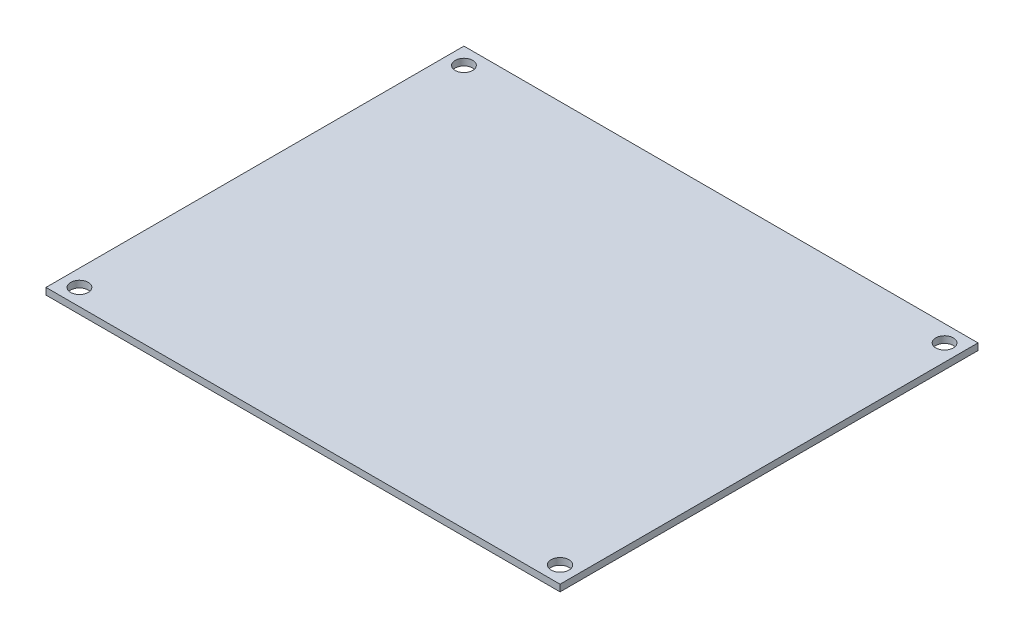
ISO-10303-21;
HEADER;
FILE_DESCRIPTION(('STEP AP214'),'2;1');
FILE_NAME('part.step','',(''),(''),'','','');
FILE_SCHEMA(('AUTOMOTIVE_DESIGN { 1 0 10303 214 1 1 1 1 }'));
ENDSEC;
DATA;
#1=APPLICATION_CONTEXT('core data for automotive mechanical design processes');
#2=APPLICATION_PROTOCOL_DEFINITION('international standard','automotive_design',2000,#1);
#3=PRODUCT_CONTEXT('',#1,'mechanical');
#4=PRODUCT('Part','Part','',(#3));
#5=PRODUCT_RELATED_PRODUCT_CATEGORY('part','',(#4));
#6=PRODUCT_DEFINITION_FORMATION('','',#4);
#7=PRODUCT_DEFINITION_CONTEXT('part definition',#1,'design');
#8=PRODUCT_DEFINITION('design','',#6,#7);
#9=PRODUCT_DEFINITION_SHAPE('','',#8);
#10=(LENGTH_UNIT() NAMED_UNIT(*) SI_UNIT(.MILLI.,.METRE.));
#11=(NAMED_UNIT(*) PLANE_ANGLE_UNIT() SI_UNIT($,.RADIAN.));
#12=(NAMED_UNIT(*) SI_UNIT($,.STERADIAN.) SOLID_ANGLE_UNIT());
#13=UNCERTAINTY_MEASURE_WITH_UNIT(LENGTH_MEASURE(1.E-05),#10,'distance_accuracy_value','');
#14=(GEOMETRIC_REPRESENTATION_CONTEXT(3) GLOBAL_UNCERTAINTY_ASSIGNED_CONTEXT((#13)) GLOBAL_UNIT_ASSIGNED_CONTEXT((#10,
#11,#12)) REPRESENTATION_CONTEXT('',''));
#15=CARTESIAN_POINT('',(0.,0.,0.));
#16=DIRECTION('',(0.,0.,1.));
#17=DIRECTION('',(1.,0.,0.));
#18=AXIS2_PLACEMENT_3D('',#15,#16,#17);
#19=CARTESIAN_POINT('',(0.,0.,0.));
#20=DIRECTION('',(0.,1.,0.));
#21=DIRECTION('',(0.,0.,1.));
#22=AXIS2_PLACEMENT_3D('',#19,#20,#21);
#23=PLANE('',#22);
#24=CARTESIAN_POINT('',(-57.5,0.,46.));
#25=DIRECTION('',(0.,1.,0.));
#26=DIRECTION('',(0.,0.,1.));
#27=AXIS2_PLACEMENT_3D('',#24,#25,#26);
#28=CIRCLE('',#27,2.1);
#29=CARTESIAN_POINT('',(-57.5,0.,48.1));
#30=VERTEX_POINT('',#29);
#31=EDGE_CURVE('E107',#30,#30,#28,.T.);
#32=ORIENTED_EDGE('',*,*,#31,.T.);
#33=EDGE_LOOP('',(#32));
#34=FACE_BOUND('',#33,.T.);
#35=CARTESIAN_POINT('',(57.5,0.,46.));
#36=DIRECTION('',(0.,1.,0.));
#37=DIRECTION('',(0.,0.,1.));
#38=AXIS2_PLACEMENT_3D('',#35,#36,#37);
#39=CIRCLE('',#38,2.15);
#40=CARTESIAN_POINT('',(57.5,0.,48.15));
#41=VERTEX_POINT('',#40);
#42=EDGE_CURVE('E112',#41,#41,#39,.T.);
#43=ORIENTED_EDGE('',*,*,#42,.T.);
#44=EDGE_LOOP('',(#43));
#45=FACE_BOUND('',#44,.T.);
#46=CARTESIAN_POINT('',(-57.5,0.,-46.));
#47=DIRECTION('',(0.,1.,0.));
#48=DIRECTION('',(0.,0.,1.));
#49=AXIS2_PLACEMENT_3D('',#46,#47,#48);
#50=CIRCLE('',#49,2.1);
#51=CARTESIAN_POINT('',(-57.5,0.,-43.9));
#52=VERTEX_POINT('',#51);
#53=EDGE_CURVE('E118',#52,#52,#50,.T.);
#54=ORIENTED_EDGE('',*,*,#53,.T.);
#55=EDGE_LOOP('',(#54));
#56=FACE_BOUND('',#55,.T.);
#57=CARTESIAN_POINT('',(57.5,0.,-46.));
#58=DIRECTION('',(0.,1.,0.));
#59=DIRECTION('',(0.,0.,1.));
#60=AXIS2_PLACEMENT_3D('',#57,#58,#59);
#61=CIRCLE('',#60,2.1);
#62=CARTESIAN_POINT('',(57.5,0.,-43.9));
#63=VERTEX_POINT('',#62);
#64=EDGE_CURVE('E124',#63,#63,#61,.T.);
#65=ORIENTED_EDGE('',*,*,#64,.T.);
#66=EDGE_LOOP('',(#65));
#67=FACE_BOUND('',#66,.T.);
#68=DIRECTION('',(0.,0.,1.));
#69=VECTOR('',#68,1.);
#70=CARTESIAN_POINT('',(-61.5,0.,-50.));
#71=LINE('',#70,#69);
#72=CARTESIAN_POINT('',(-61.5,0.,-50.));
#73=VERTEX_POINT('',#72);
#74=CARTESIAN_POINT('',(-61.5,0.,50.));
#75=VERTEX_POINT('',#74);
#76=EDGE_CURVE('E134',#73,#75,#71,.T.);
#77=ORIENTED_EDGE('',*,*,#76,.F.);
#78=DIRECTION('',(-1.,0.,0.));
#79=VECTOR('',#78,1.);
#80=CARTESIAN_POINT('',(61.5,0.,-50.));
#81=LINE('',#80,#79);
#82=CARTESIAN_POINT('',(61.5,0.,-50.));
#83=VERTEX_POINT('',#82);
#84=EDGE_CURVE('E55',#83,#73,#81,.T.);
#85=ORIENTED_EDGE('',*,*,#84,.F.);
#86=DIRECTION('',(0.,0.,-1.));
#87=VECTOR('',#86,1.);
#88=CARTESIAN_POINT('',(61.5,0.,50.));
#89=LINE('',#88,#87);
#90=CARTESIAN_POINT('',(61.5,0.,50.));
#91=VERTEX_POINT('',#90);
#92=EDGE_CURVE('E57',#91,#83,#89,.T.);
#93=ORIENTED_EDGE('',*,*,#92,.F.);
#94=DIRECTION('',(1.,0.,0.));
#95=VECTOR('',#94,1.);
#96=CARTESIAN_POINT('',(-61.5,0.,50.));
#97=LINE('',#96,#95);
#98=EDGE_CURVE('E59',#75,#91,#97,.T.);
#99=ORIENTED_EDGE('',*,*,#98,.F.);
#100=EDGE_LOOP('',(#77,#85,#93,#99));
#101=FACE_BOUND('',#100,.T.);
#102=ADVANCED_FACE('F16',(#34,#45,#56,#67,#101),#23,.F.);
#103=CARTESIAN_POINT('',(-61.5,0.,50.));
#104=DIRECTION('',(0.,0.,1.));
#105=DIRECTION('',(1.,0.,0.));
#106=AXIS2_PLACEMENT_3D('',#103,#104,#105);
#107=PLANE('',#106);
#108=DIRECTION('',(1.,0.,0.));
#109=VECTOR('',#108,1.);
#110=CARTESIAN_POINT('',(0.,1.6,50.));
#111=LINE('',#110,#109);
#112=CARTESIAN_POINT('',(-61.5,1.6,50.));
#113=VERTEX_POINT('',#112);
#114=CARTESIAN_POINT('',(61.5,1.6,50.));
#115=VERTEX_POINT('',#114);
#116=EDGE_CURVE('E111',#113,#115,#111,.T.);
#117=ORIENTED_EDGE('',*,*,#116,.F.);
#118=DIRECTION('',(0.,1.,0.));
#119=VECTOR('',#118,1.);
#120=CARTESIAN_POINT('',(-61.5,0.,50.));
#121=LINE('',#120,#119);
#122=EDGE_CURVE('E71',#75,#113,#121,.T.);
#123=ORIENTED_EDGE('',*,*,#122,.F.);
#124=ORIENTED_EDGE('',*,*,#98,.T.);
#125=DIRECTION('',(0.,1.,0.));
#126=VECTOR('',#125,1.);
#127=CARTESIAN_POINT('',(61.5,0.,50.));
#128=LINE('',#127,#126);
#129=EDGE_CURVE('E65',#115,#91,#128,.F.);
#130=ORIENTED_EDGE('',*,*,#129,.F.);
#131=EDGE_LOOP('',(#117,#123,#124,#130));
#132=FACE_BOUND('',#131,.T.);
#133=ADVANCED_FACE('F68',(#132),#107,.T.);
#134=CARTESIAN_POINT('',(61.5,0.,50.));
#135=DIRECTION('',(1.,0.,0.));
#136=DIRECTION('',(0.,0.,-1.));
#137=AXIS2_PLACEMENT_3D('',#134,#135,#136);
#138=PLANE('',#137);
#139=DIRECTION('',(0.,0.,1.));
#140=VECTOR('',#139,1.);
#141=CARTESIAN_POINT('',(61.5,1.6,0.));
#142=LINE('',#141,#140);
#143=CARTESIAN_POINT('',(61.5,1.6,-50.));
#144=VERTEX_POINT('',#143);
#145=EDGE_CURVE('E77',#115,#144,#142,.F.);
#146=ORIENTED_EDGE('',*,*,#145,.F.);
#147=ORIENTED_EDGE('',*,*,#129,.T.);
#148=ORIENTED_EDGE('',*,*,#92,.T.);
#149=DIRECTION('',(0.,1.,0.));
#150=VECTOR('',#149,1.);
#151=CARTESIAN_POINT('',(61.5,0.,-50.));
#152=LINE('',#151,#150);
#153=EDGE_CURVE('E83',#144,#83,#152,.F.);
#154=ORIENTED_EDGE('',*,*,#153,.F.);
#155=EDGE_LOOP('',(#146,#147,#148,#154));
#156=FACE_BOUND('',#155,.T.);
#157=ADVANCED_FACE('F75',(#156),#138,.T.);
#158=CARTESIAN_POINT('',(61.5,0.,-50.));
#159=DIRECTION('',(0.,0.,-1.));
#160=DIRECTION('',(-1.,0.,0.));
#161=AXIS2_PLACEMENT_3D('',#158,#159,#160);
#162=PLANE('',#161);
#163=DIRECTION('',(1.,0.,0.));
#164=VECTOR('',#163,1.);
#165=CARTESIAN_POINT('',(0.,1.6,-50.));
#166=LINE('',#165,#164);
#167=CARTESIAN_POINT('',(-61.5,1.6,-50.));
#168=VERTEX_POINT('',#167);
#169=EDGE_CURVE('E143',#144,#168,#166,.F.);
#170=ORIENTED_EDGE('',*,*,#169,.F.);
#171=ORIENTED_EDGE('',*,*,#153,.T.);
#172=ORIENTED_EDGE('',*,*,#84,.T.);
#173=DIRECTION('',(0.,1.,0.));
#174=VECTOR('',#173,1.);
#175=CARTESIAN_POINT('',(-61.5,0.,-50.));
#176=LINE('',#175,#174);
#177=EDGE_CURVE('E35',#168,#73,#176,.F.);
#178=ORIENTED_EDGE('',*,*,#177,.F.);
#179=EDGE_LOOP('',(#170,#171,#172,#178));
#180=FACE_BOUND('',#179,.T.);
#181=ADVANCED_FACE('F141',(#180),#162,.T.);
#182=CARTESIAN_POINT('',(-61.5,0.,-50.));
#183=DIRECTION('',(-1.,0.,0.));
#184=DIRECTION('',(0.,0.,1.));
#185=AXIS2_PLACEMENT_3D('',#182,#183,#184);
#186=PLANE('',#185);
#187=DIRECTION('',(0.,0.,1.));
#188=VECTOR('',#187,1.);
#189=CARTESIAN_POINT('',(-61.5,1.6,0.));
#190=LINE('',#189,#188);
#191=EDGE_CURVE('E104',#168,#113,#190,.T.);
#192=ORIENTED_EDGE('',*,*,#191,.F.);
#193=ORIENTED_EDGE('',*,*,#177,.T.);
#194=ORIENTED_EDGE('',*,*,#76,.T.);
#195=ORIENTED_EDGE('',*,*,#122,.T.);
#196=EDGE_LOOP('',(#192,#193,#194,#195));
#197=FACE_BOUND('',#196,.T.);
#198=ADVANCED_FACE('F153',(#197),#186,.T.);
#199=CARTESIAN_POINT('',(57.5,0.,-46.));
#200=DIRECTION('',(0.,1.,0.));
#201=DIRECTION('',(0.,0.,1.));
#202=AXIS2_PLACEMENT_3D('',#199,#200,#201);
#203=CYLINDRICAL_SURFACE('',#202,2.1);
#204=ORIENTED_EDGE('',*,*,#64,.F.);
#205=EDGE_LOOP('',(#204));
#206=FACE_BOUND('',#205,.T.);
#207=CARTESIAN_POINT('',(57.5,1.6,-46.));
#208=DIRECTION('',(0.,1.,0.));
#209=DIRECTION('',(0.,0.,1.));
#210=AXIS2_PLACEMENT_3D('',#207,#208,#209);
#211=CIRCLE('',#210,2.1);
#212=CARTESIAN_POINT('',(57.5,1.6,-43.9));
#213=VERTEX_POINT('',#212);
#214=EDGE_CURVE('E98',#213,#213,#211,.F.);
#215=ORIENTED_EDGE('',*,*,#214,.F.);
#216=EDGE_LOOP('',(#215));
#217=FACE_BOUND('',#216,.T.);
#218=ADVANCED_FACE('F155',(#206,#217),#203,.F.);
#219=CARTESIAN_POINT('',(-57.5,0.,-46.));
#220=DIRECTION('',(0.,1.,0.));
#221=DIRECTION('',(0.,0.,1.));
#222=AXIS2_PLACEMENT_3D('',#219,#220,#221);
#223=CYLINDRICAL_SURFACE('',#222,2.1);
#224=ORIENTED_EDGE('',*,*,#53,.F.);
#225=EDGE_LOOP('',(#224));
#226=FACE_BOUND('',#225,.T.);
#227=CARTESIAN_POINT('',(-57.5,1.6,-46.));
#228=DIRECTION('',(0.,1.,0.));
#229=DIRECTION('',(0.,0.,1.));
#230=AXIS2_PLACEMENT_3D('',#227,#228,#229);
#231=CIRCLE('',#230,2.1);
#232=CARTESIAN_POINT('',(-57.5,1.6,-43.9));
#233=VERTEX_POINT('',#232);
#234=EDGE_CURVE('E92',#233,#233,#231,.F.);
#235=ORIENTED_EDGE('',*,*,#234,.F.);
#236=EDGE_LOOP('',(#235));
#237=FACE_BOUND('',#236,.T.);
#238=ADVANCED_FACE('F162',(#226,#237),#223,.F.);
#239=CARTESIAN_POINT('',(57.5,0.,46.));
#240=DIRECTION('',(0.,1.,0.));
#241=DIRECTION('',(0.,0.,1.));
#242=AXIS2_PLACEMENT_3D('',#239,#240,#241);
#243=CYLINDRICAL_SURFACE('',#242,2.15);
#244=ORIENTED_EDGE('',*,*,#42,.F.);
#245=EDGE_LOOP('',(#244));
#246=FACE_BOUND('',#245,.T.);
#247=CARTESIAN_POINT('',(57.5,1.6,46.));
#248=DIRECTION('',(0.,1.,0.));
#249=DIRECTION('',(0.,0.,1.));
#250=AXIS2_PLACEMENT_3D('',#247,#248,#249);
#251=CIRCLE('',#250,2.15);
#252=CARTESIAN_POINT('',(57.5,1.6,48.15));
#253=VERTEX_POINT('',#252);
#254=EDGE_CURVE('E26',#253,#253,#251,.F.);
#255=ORIENTED_EDGE('',*,*,#254,.F.);
#256=EDGE_LOOP('',(#255));
#257=FACE_BOUND('',#256,.T.);
#258=ADVANCED_FACE('F173',(#246,#257),#243,.F.);
#259=CARTESIAN_POINT('',(-57.5,0.,46.));
#260=DIRECTION('',(0.,1.,0.));
#261=DIRECTION('',(0.,0.,1.));
#262=AXIS2_PLACEMENT_3D('',#259,#260,#261);
#263=CYLINDRICAL_SURFACE('',#262,2.1);
#264=ORIENTED_EDGE('',*,*,#31,.F.);
#265=EDGE_LOOP('',(#264));
#266=FACE_BOUND('',#265,.T.);
#267=CARTESIAN_POINT('',(-57.5,1.6,46.));
#268=DIRECTION('',(0.,1.,0.));
#269=DIRECTION('',(0.,0.,1.));
#270=AXIS2_PLACEMENT_3D('',#267,#268,#269);
#271=CIRCLE('',#270,2.1);
#272=CARTESIAN_POINT('',(-57.5,1.6,48.1));
#273=VERTEX_POINT('',#272);
#274=EDGE_CURVE('E10',#273,#273,#271,.F.);
#275=ORIENTED_EDGE('',*,*,#274,.F.);
#276=EDGE_LOOP('',(#275));
#277=FACE_BOUND('',#276,.T.);
#278=ADVANCED_FACE('F167',(#266,#277),#263,.F.);
#279=CARTESIAN_POINT('',(0.,1.6,0.));
#280=DIRECTION('',(0.,1.,0.));
#281=DIRECTION('',(0.,0.,1.));
#282=AXIS2_PLACEMENT_3D('',#279,#280,#281);
#283=PLANE('',#282);
#284=ORIENTED_EDGE('',*,*,#274,.T.);
#285=EDGE_LOOP('',(#284));
#286=FACE_BOUND('',#285,.T.);
#287=ORIENTED_EDGE('',*,*,#254,.T.);
#288=EDGE_LOOP('',(#287));
#289=FACE_BOUND('',#288,.T.);
#290=ORIENTED_EDGE('',*,*,#234,.T.);
#291=EDGE_LOOP('',(#290));
#292=FACE_BOUND('',#291,.T.);
#293=ORIENTED_EDGE('',*,*,#214,.T.);
#294=EDGE_LOOP('',(#293));
#295=FACE_BOUND('',#294,.T.);
#296=ORIENTED_EDGE('',*,*,#169,.T.);
#297=ORIENTED_EDGE('',*,*,#191,.T.);
#298=ORIENTED_EDGE('',*,*,#116,.T.);
#299=ORIENTED_EDGE('',*,*,#145,.T.);
#300=EDGE_LOOP('',(#296,#297,#298,#299));
#301=FACE_BOUND('',#300,.T.);
#302=ADVANCED_FACE('F148',(#286,#289,#292,#295,#301),#283,.T.);
#303=CLOSED_SHELL('',(#102,#133,#157,#181,#198,#218,#238,#258,#278,#302));
#304=MANIFOLD_SOLID_BREP('B1',#303);
#305=ADVANCED_BREP_SHAPE_REPRESENTATION('',(#18,#304),#14);
#306=SHAPE_DEFINITION_REPRESENTATION(#9,#305);
ENDSEC;
END-ISO-10303-21;
